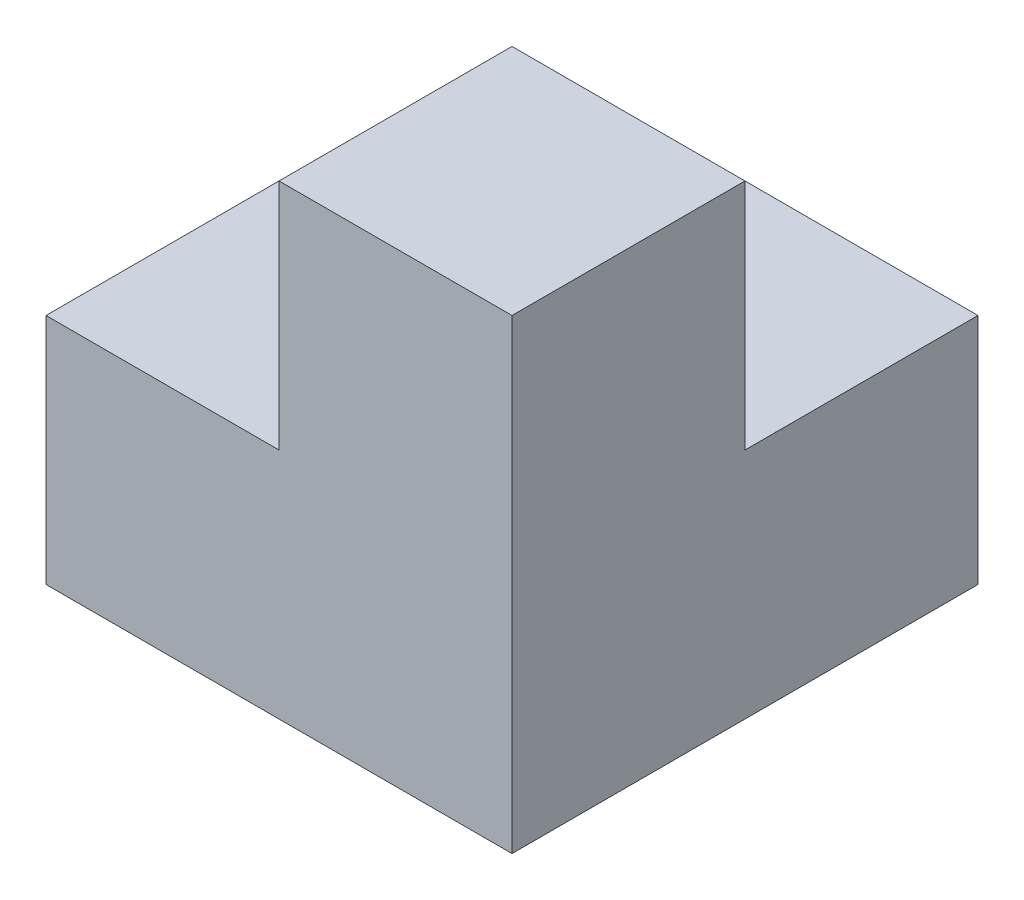
ISO-10303-21;
HEADER;
FILE_DESCRIPTION(('STEP AP214'),'2;1');
FILE_NAME('part.step','',(''),(''),'','','');
FILE_SCHEMA(('AUTOMOTIVE_DESIGN { 1 0 10303 214 1 1 1 1 }'));
ENDSEC;
DATA;
#1=APPLICATION_CONTEXT('core data for automotive mechanical design processes');
#2=APPLICATION_PROTOCOL_DEFINITION('international standard','automotive_design',2000,#1);
#3=PRODUCT_CONTEXT('',#1,'mechanical');
#4=PRODUCT('Part','Part','',(#3));
#5=PRODUCT_RELATED_PRODUCT_CATEGORY('part','',(#4));
#6=PRODUCT_DEFINITION_FORMATION('','',#4);
#7=PRODUCT_DEFINITION_CONTEXT('part definition',#1,'design');
#8=PRODUCT_DEFINITION('design','',#6,#7);
#9=PRODUCT_DEFINITION_SHAPE('','',#8);
#10=(LENGTH_UNIT() NAMED_UNIT(*) SI_UNIT(.MILLI.,.METRE.));
#11=(NAMED_UNIT(*) PLANE_ANGLE_UNIT() SI_UNIT($,.RADIAN.));
#12=(NAMED_UNIT(*) SI_UNIT($,.STERADIAN.) SOLID_ANGLE_UNIT());
#13=UNCERTAINTY_MEASURE_WITH_UNIT(LENGTH_MEASURE(1.E-05),#10,'distance_accuracy_value','');
#14=(GEOMETRIC_REPRESENTATION_CONTEXT(3) GLOBAL_UNCERTAINTY_ASSIGNED_CONTEXT((#13)) GLOBAL_UNIT_ASSIGNED_CONTEXT((#10,
#11,#12)) REPRESENTATION_CONTEXT('',''));
#15=CARTESIAN_POINT('',(0.,0.,0.));
#16=DIRECTION('',(0.,0.,1.));
#17=DIRECTION('',(1.,0.,0.));
#18=AXIS2_PLACEMENT_3D('',#15,#16,#17);
#19=CARTESIAN_POINT('',(0.,4.,0.));
#20=DIRECTION('',(1.,0.,0.));
#21=DIRECTION('',(0.,0.,-1.));
#22=AXIS2_PLACEMENT_3D('',#19,#20,#21);
#23=PLANE('',#22);
#24=DIRECTION('',(0.,0.,1.));
#25=VECTOR('',#24,1.);
#26=CARTESIAN_POINT('',(0.,2.,0.));
#27=LINE('',#26,#25);
#28=CARTESIAN_POINT('',(0.,2.,-4.));
#29=VERTEX_POINT('',#28);
#30=CARTESIAN_POINT('',(0.,2.,0.));
#31=VERTEX_POINT('',#30);
#32=EDGE_CURVE('E121',#29,#31,#27,.T.);
#33=ORIENTED_EDGE('',*,*,#32,.F.);
#34=DIRECTION('',(0.,-1.,0.));
#35=VECTOR('',#34,1.);
#36=CARTESIAN_POINT('',(0.,4.,-4.));
#37=LINE('',#36,#35);
#38=CARTESIAN_POINT('',(0.,0.,-4.));
#39=VERTEX_POINT('',#38);
#40=EDGE_CURVE('E86',#29,#39,#37,.T.);
#41=ORIENTED_EDGE('',*,*,#40,.T.);
#42=DIRECTION('',(0.,0.,1.));
#43=VECTOR('',#42,1.);
#44=CARTESIAN_POINT('',(0.,0.,0.));
#45=LINE('',#44,#43);
#46=CARTESIAN_POINT('',(0.,0.,0.));
#47=VERTEX_POINT('',#46);
#48=EDGE_CURVE('E99',#39,#47,#45,.T.);
#49=ORIENTED_EDGE('',*,*,#48,.T.);
#50=DIRECTION('',(0.,-1.,0.));
#51=VECTOR('',#50,1.);
#52=CARTESIAN_POINT('',(0.,4.,0.));
#53=LINE('',#52,#51);
#54=EDGE_CURVE('E11',#31,#47,#53,.T.);
#55=ORIENTED_EDGE('',*,*,#54,.F.);
#56=EDGE_LOOP('',(#33,#41,#49,#55));
#57=FACE_BOUND('',#56,.T.);
#58=ADVANCED_FACE('F33',(#57),#23,.F.);
#59=CARTESIAN_POINT('',(0.,4.,0.));
#60=DIRECTION('',(0.,0.,-1.));
#61=DIRECTION('',(-1.,0.,0.));
#62=AXIS2_PLACEMENT_3D('',#59,#60,#61);
#63=PLANE('',#62);
#64=DIRECTION('',(0.,1.,0.));
#65=VECTOR('',#64,1.);
#66=CARTESIAN_POINT('',(2.,2.,0.));
#67=LINE('',#66,#65);
#68=CARTESIAN_POINT('',(2.,2.,0.));
#69=VERTEX_POINT('',#68);
#70=CARTESIAN_POINT('',(2.,4.,0.));
#71=VERTEX_POINT('',#70);
#72=EDGE_CURVE('E112',#69,#71,#67,.T.);
#73=ORIENTED_EDGE('',*,*,#72,.F.);
#74=DIRECTION('',(1.,0.,0.));
#75=VECTOR('',#74,1.);
#76=CARTESIAN_POINT('',(0.,2.,0.));
#77=LINE('',#76,#75);
#78=EDGE_CURVE('E153',#31,#69,#77,.T.);
#79=ORIENTED_EDGE('',*,*,#78,.F.);
#80=ORIENTED_EDGE('',*,*,#54,.T.);
#81=DIRECTION('',(1.,0.,0.));
#82=VECTOR('',#81,1.);
#83=CARTESIAN_POINT('',(0.,0.,0.));
#84=LINE('',#83,#82);
#85=CARTESIAN_POINT('',(4.,0.,0.));
#86=VERTEX_POINT('',#85);
#87=EDGE_CURVE('E95',#47,#86,#84,.T.);
#88=ORIENTED_EDGE('',*,*,#87,.T.);
#89=DIRECTION('',(0.,-1.,0.));
#90=VECTOR('',#89,1.);
#91=CARTESIAN_POINT('',(4.,4.,0.));
#92=LINE('',#91,#90);
#93=CARTESIAN_POINT('',(4.,4.,0.));
#94=VERTEX_POINT('',#93);
#95=EDGE_CURVE('E40',#94,#86,#92,.T.);
#96=ORIENTED_EDGE('',*,*,#95,.F.);
#97=DIRECTION('',(1.,0.,0.));
#98=VECTOR('',#97,1.);
#99=CARTESIAN_POINT('',(0.,4.,0.));
#100=LINE('',#99,#98);
#101=EDGE_CURVE('E55',#71,#94,#100,.T.);
#102=ORIENTED_EDGE('',*,*,#101,.F.);
#103=EDGE_LOOP('',(#73,#79,#80,#88,#96,#102));
#104=FACE_BOUND('',#103,.T.);
#105=ADVANCED_FACE('F115',(#104),#63,.F.);
#106=CARTESIAN_POINT('',(0.,4.,-4.));
#107=DIRECTION('',(0.,0.,1.));
#108=DIRECTION('',(1.,0.,0.));
#109=AXIS2_PLACEMENT_3D('',#106,#107,#108);
#110=PLANE('',#109);
#111=DIRECTION('',(-1.,0.,0.));
#112=VECTOR('',#111,1.);
#113=CARTESIAN_POINT('',(0.,2.,-4.));
#114=LINE('',#113,#112);
#115=CARTESIAN_POINT('',(4.,2.,-4.));
#116=VERTEX_POINT('',#115);
#117=EDGE_CURVE('E83',#116,#29,#114,.T.);
#118=ORIENTED_EDGE('',*,*,#117,.F.);
#119=DIRECTION('',(0.,-1.,0.));
#120=VECTOR('',#119,1.);
#121=CARTESIAN_POINT('',(4.,4.,-4.));
#122=LINE('',#121,#120);
#123=CARTESIAN_POINT('',(4.,0.,-4.));
#124=VERTEX_POINT('',#123);
#125=EDGE_CURVE('E74',#116,#124,#122,.T.);
#126=ORIENTED_EDGE('',*,*,#125,.T.);
#127=DIRECTION('',(-1.,0.,0.));
#128=VECTOR('',#127,1.);
#129=CARTESIAN_POINT('',(0.,0.,-4.));
#130=LINE('',#129,#128);
#131=EDGE_CURVE('E79',#124,#39,#130,.T.);
#132=ORIENTED_EDGE('',*,*,#131,.T.);
#133=ORIENTED_EDGE('',*,*,#40,.F.);
#134=EDGE_LOOP('',(#118,#126,#132,#133));
#135=FACE_BOUND('',#134,.T.);
#136=ADVANCED_FACE('F76',(#135),#110,.F.);
#137=CARTESIAN_POINT('',(0.,4.,0.));
#138=DIRECTION('',(0.,-1.,0.));
#139=DIRECTION('',(0.,0.,-1.));
#140=AXIS2_PLACEMENT_3D('',#137,#138,#139);
#141=PLANE('',#140);
#142=DIRECTION('',(0.,0.,1.));
#143=VECTOR('',#142,1.);
#144=CARTESIAN_POINT('',(2.,4.,0.));
#145=LINE('',#144,#143);
#146=CARTESIAN_POINT('',(2.,4.,-2.));
#147=VERTEX_POINT('',#146);
#148=EDGE_CURVE('E47',#147,#71,#145,.T.);
#149=ORIENTED_EDGE('',*,*,#148,.T.);
#150=ORIENTED_EDGE('',*,*,#101,.T.);
#151=DIRECTION('',(0.,0.,-1.));
#152=VECTOR('',#151,1.);
#153=CARTESIAN_POINT('',(4.,4.,0.));
#154=LINE('',#153,#152);
#155=CARTESIAN_POINT('',(4.,4.,-2.));
#156=VERTEX_POINT('',#155);
#157=EDGE_CURVE('E101',#94,#156,#154,.T.);
#158=ORIENTED_EDGE('',*,*,#157,.T.);
#159=DIRECTION('',(1.,0.,0.));
#160=VECTOR('',#159,1.);
#161=CARTESIAN_POINT('',(0.,4.,-2.));
#162=LINE('',#161,#160);
#163=EDGE_CURVE('E132',#147,#156,#162,.T.);
#164=ORIENTED_EDGE('',*,*,#163,.F.);
#165=EDGE_LOOP('',(#149,#150,#158,#164));
#166=FACE_BOUND('',#165,.T.);
#167=ADVANCED_FACE('F160',(#166),#141,.F.);
#168=CARTESIAN_POINT('',(4.,4.,0.));
#169=DIRECTION('',(-1.,0.,0.));
#170=DIRECTION('',(0.,0.,1.));
#171=AXIS2_PLACEMENT_3D('',#168,#169,#170);
#172=PLANE('',#171);
#173=DIRECTION('',(0.,0.,-1.));
#174=VECTOR('',#173,1.);
#175=CARTESIAN_POINT('',(4.,2.,0.));
#176=LINE('',#175,#174);
#177=CARTESIAN_POINT('',(4.,2.,-2.));
#178=VERTEX_POINT('',#177);
#179=EDGE_CURVE('E142',#178,#116,#176,.T.);
#180=ORIENTED_EDGE('',*,*,#179,.F.);
#181=DIRECTION('',(0.,1.,0.));
#182=VECTOR('',#181,1.);
#183=CARTESIAN_POINT('',(4.,2.,-2.));
#184=LINE('',#183,#182);
#185=EDGE_CURVE('E158',#178,#156,#184,.T.);
#186=ORIENTED_EDGE('',*,*,#185,.T.);
#187=ORIENTED_EDGE('',*,*,#157,.F.);
#188=ORIENTED_EDGE('',*,*,#95,.T.);
#189=DIRECTION('',(0.,0.,-1.));
#190=VECTOR('',#189,1.);
#191=CARTESIAN_POINT('',(4.,0.,0.));
#192=LINE('',#191,#190);
#193=EDGE_CURVE('E90',#86,#124,#192,.T.);
#194=ORIENTED_EDGE('',*,*,#193,.T.);
#195=ORIENTED_EDGE('',*,*,#125,.F.);
#196=EDGE_LOOP('',(#180,#186,#187,#188,#194,#195));
#197=FACE_BOUND('',#196,.T.);
#198=ADVANCED_FACE('F91',(#197),#172,.F.);
#199=CARTESIAN_POINT('',(0.,0.,0.));
#200=DIRECTION('',(0.,-1.,0.));
#201=DIRECTION('',(0.,0.,-1.));
#202=AXIS2_PLACEMENT_3D('',#199,#200,#201);
#203=PLANE('',#202);
#204=ORIENTED_EDGE('',*,*,#48,.F.);
#205=ORIENTED_EDGE('',*,*,#131,.F.);
#206=ORIENTED_EDGE('',*,*,#193,.F.);
#207=ORIENTED_EDGE('',*,*,#87,.F.);
#208=EDGE_LOOP('',(#204,#205,#206,#207));
#209=FACE_BOUND('',#208,.T.);
#210=ADVANCED_FACE('F97',(#209),#203,.T.);
#211=CARTESIAN_POINT('',(2.,2.,0.));
#212=DIRECTION('',(-1.,0.,0.));
#213=DIRECTION('',(0.,0.,1.));
#214=AXIS2_PLACEMENT_3D('',#211,#212,#213);
#215=PLANE('',#214);
#216=ORIENTED_EDGE('',*,*,#148,.F.);
#217=DIRECTION('',(0.,1.,0.));
#218=VECTOR('',#217,1.);
#219=CARTESIAN_POINT('',(2.,2.,-2.));
#220=LINE('',#219,#218);
#221=CARTESIAN_POINT('',(2.,2.,-2.));
#222=VERTEX_POINT('',#221);
#223=EDGE_CURVE('E137',#222,#147,#220,.T.);
#224=ORIENTED_EDGE('',*,*,#223,.F.);
#225=DIRECTION('',(0.,0.,1.));
#226=VECTOR('',#225,1.);
#227=CARTESIAN_POINT('',(2.,2.,0.));
#228=LINE('',#227,#226);
#229=EDGE_CURVE('E148',#222,#69,#228,.T.);
#230=ORIENTED_EDGE('',*,*,#229,.T.);
#231=ORIENTED_EDGE('',*,*,#72,.T.);
#232=EDGE_LOOP('',(#216,#224,#230,#231));
#233=FACE_BOUND('',#232,.T.);
#234=ADVANCED_FACE('F161',(#233),#215,.T.);
#235=CARTESIAN_POINT('',(0.,2.,-2.));
#236=DIRECTION('',(0.,0.,1.));
#237=DIRECTION('',(1.,0.,0.));
#238=AXIS2_PLACEMENT_3D('',#235,#236,#237);
#239=PLANE('',#238);
#240=ORIENTED_EDGE('',*,*,#163,.T.);
#241=ORIENTED_EDGE('',*,*,#185,.F.);
#242=DIRECTION('',(1.,0.,0.));
#243=VECTOR('',#242,1.);
#244=CARTESIAN_POINT('',(0.,2.,-2.));
#245=LINE('',#244,#243);
#246=EDGE_CURVE('E145',#222,#178,#245,.T.);
#247=ORIENTED_EDGE('',*,*,#246,.F.);
#248=ORIENTED_EDGE('',*,*,#223,.T.);
#249=EDGE_LOOP('',(#240,#241,#247,#248));
#250=FACE_BOUND('',#249,.T.);
#251=ADVANCED_FACE('F159',(#250),#239,.F.);
#252=CARTESIAN_POINT('',(0.,2.,0.));
#253=DIRECTION('',(0.,1.,0.));
#254=DIRECTION('',(0.,0.,1.));
#255=AXIS2_PLACEMENT_3D('',#252,#253,#254);
#256=PLANE('',#255);
#257=ORIENTED_EDGE('',*,*,#229,.F.);
#258=ORIENTED_EDGE('',*,*,#246,.T.);
#259=ORIENTED_EDGE('',*,*,#179,.T.);
#260=ORIENTED_EDGE('',*,*,#117,.T.);
#261=ORIENTED_EDGE('',*,*,#32,.T.);
#262=ORIENTED_EDGE('',*,*,#78,.T.);
#263=EDGE_LOOP('',(#257,#258,#259,#260,#261,#262));
#264=FACE_BOUND('',#263,.T.);
#265=ADVANCED_FACE('F143',(#264),#256,.T.);
#266=CLOSED_SHELL('',(#58,#105,#136,#167,#198,#210,#234,#251,#265));
#267=MANIFOLD_SOLID_BREP('B2',#266);
#268=ADVANCED_BREP_SHAPE_REPRESENTATION('',(#18,#267),#14);
#269=SHAPE_DEFINITION_REPRESENTATION(#9,#268);
ENDSEC;
END-ISO-10303-21;
